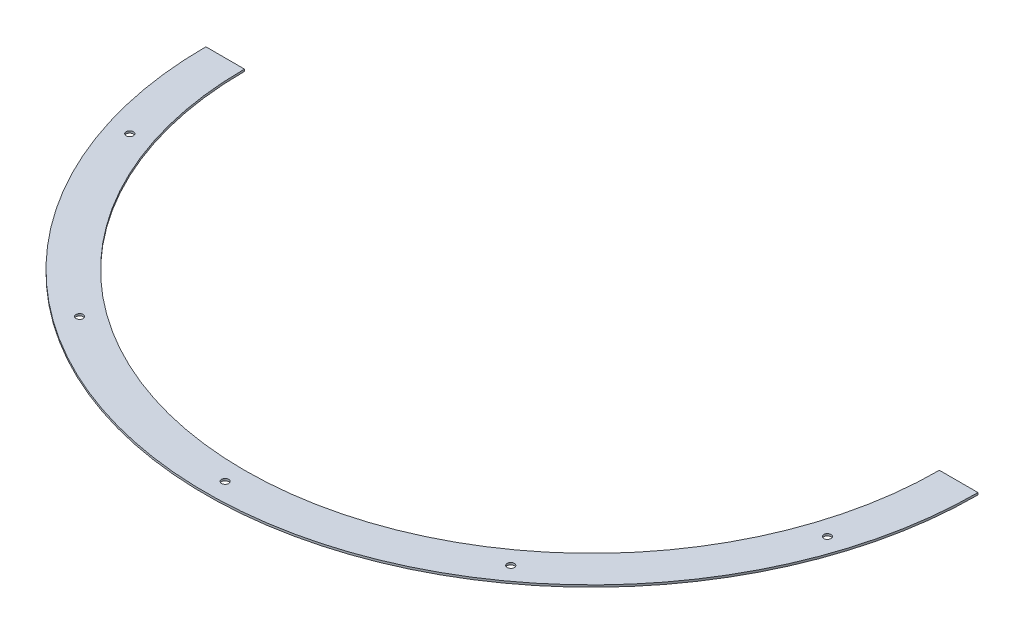
ISO-10303-21;
HEADER;
FILE_DESCRIPTION(('STEP AP214'),'2;1');
FILE_NAME('part.step','',(''),(''),'','','');
FILE_SCHEMA(('AUTOMOTIVE_DESIGN { 1 0 10303 214 1 1 1 1 }'));
ENDSEC;
DATA;
#1=APPLICATION_CONTEXT('core data for automotive mechanical design processes');
#2=APPLICATION_PROTOCOL_DEFINITION('international standard','automotive_design',2000,#1);
#3=PRODUCT_CONTEXT('',#1,'mechanical');
#4=PRODUCT('Part','Part','',(#3));
#5=PRODUCT_RELATED_PRODUCT_CATEGORY('part','',(#4));
#6=PRODUCT_DEFINITION_FORMATION('','',#4);
#7=PRODUCT_DEFINITION_CONTEXT('part definition',#1,'design');
#8=PRODUCT_DEFINITION('design','',#6,#7);
#9=PRODUCT_DEFINITION_SHAPE('','',#8);
#10=(LENGTH_UNIT() NAMED_UNIT(*) SI_UNIT(.MILLI.,.METRE.));
#11=(NAMED_UNIT(*) PLANE_ANGLE_UNIT() SI_UNIT($,.RADIAN.));
#12=(NAMED_UNIT(*) SI_UNIT($,.STERADIAN.) SOLID_ANGLE_UNIT());
#13=UNCERTAINTY_MEASURE_WITH_UNIT(LENGTH_MEASURE(1.E-05),#10,'distance_accuracy_value','');
#14=(GEOMETRIC_REPRESENTATION_CONTEXT(3) GLOBAL_UNCERTAINTY_ASSIGNED_CONTEXT((#13)) GLOBAL_UNIT_ASSIGNED_CONTEXT((#10,
#11,#12)) REPRESENTATION_CONTEXT('',''));
#15=CARTESIAN_POINT('',(0.,0.,0.));
#16=DIRECTION('',(0.,0.,1.));
#17=DIRECTION('',(1.,0.,0.));
#18=AXIS2_PLACEMENT_3D('',#15,#16,#17);
#19=CARTESIAN_POINT('',(0.,0.,0.));
#20=DIRECTION('',(0.,0.,1.));
#21=DIRECTION('',(0.,1.,0.));
#22=AXIS2_PLACEMENT_3D('',#19,#20,#21);
#23=PLANE('',#22);
#24=DIRECTION('',(1.,0.,0.));
#25=VECTOR('',#24,1.);
#26=CARTESIAN_POINT('',(0.,2.032,0.));
#27=LINE('',#26,#25);
#28=CARTESIAN_POINT('',(-381.,2.032,0.));
#29=VERTEX_POINT('',#28);
#30=CARTESIAN_POINT('',(-342.9,2.032,0.));
#31=VERTEX_POINT('',#30);
#32=EDGE_CURVE('E70',#29,#31,#27,.T.);
#33=ORIENTED_EDGE('',*,*,#32,.T.);
#34=DIRECTION('',(0.,-1.,0.));
#35=VECTOR('',#34,1.);
#36=CARTESIAN_POINT('',(-342.9,2.032,0.));
#37=LINE('',#36,#35);
#38=CARTESIAN_POINT('',(-342.9,0.,0.));
#39=VERTEX_POINT('',#38);
#40=EDGE_CURVE('E30',#31,#39,#37,.T.);
#41=ORIENTED_EDGE('',*,*,#40,.T.);
#42=DIRECTION('',(1.,0.,0.));
#43=VECTOR('',#42,1.);
#44=CARTESIAN_POINT('',(0.,0.,0.));
#45=LINE('',#44,#43);
#46=CARTESIAN_POINT('',(-381.,0.,0.));
#47=VERTEX_POINT('',#46);
#48=EDGE_CURVE('E71',#47,#39,#45,.T.);
#49=ORIENTED_EDGE('',*,*,#48,.F.);
#50=DIRECTION('',(0.,-1.,0.));
#51=VECTOR('',#50,1.);
#52=CARTESIAN_POINT('',(-381.,2.032,0.));
#53=LINE('',#52,#51);
#54=EDGE_CURVE('E68',#29,#47,#53,.T.);
#55=ORIENTED_EDGE('',*,*,#54,.F.);
#56=EDGE_LOOP('',(#33,#41,#49,#55));
#57=FACE_BOUND('',#56,.T.);
#58=ADVANCED_FACE('F26',(#57),#23,.F.);
#59=CARTESIAN_POINT('',(342.9,0.,0.));
#60=VERTEX_POINT('',#59);
#61=CARTESIAN_POINT('',(381.,0.,0.));
#62=VERTEX_POINT('',#61);
#63=EDGE_CURVE('E76',#60,#62,#45,.T.);
#64=ORIENTED_EDGE('',*,*,#63,.F.);
#65=DIRECTION('',(0.,-1.,0.));
#66=VECTOR('',#65,1.);
#67=CARTESIAN_POINT('',(342.9,2.032,0.));
#68=LINE('',#67,#66);
#69=CARTESIAN_POINT('',(342.9,2.032,0.));
#70=VERTEX_POINT('',#69);
#71=EDGE_CURVE('E11',#60,#70,#68,.F.);
#72=ORIENTED_EDGE('',*,*,#71,.T.);
#73=CARTESIAN_POINT('',(381.,2.032,0.));
#74=VERTEX_POINT('',#73);
#75=EDGE_CURVE('E48',#70,#74,#27,.T.);
#76=ORIENTED_EDGE('',*,*,#75,.T.);
#77=DIRECTION('',(0.,-1.,0.));
#78=VECTOR('',#77,1.);
#79=CARTESIAN_POINT('',(381.,2.032,0.));
#80=LINE('',#79,#78);
#81=EDGE_CURVE('E77',#62,#74,#80,.F.);
#82=ORIENTED_EDGE('',*,*,#81,.F.);
#83=EDGE_LOOP('',(#64,#72,#76,#82));
#84=FACE_BOUND('',#83,.T.);
#85=ADVANCED_FACE('F128',(#84),#23,.F.);
#86=CARTESIAN_POINT('',(0.,2.032,0.));
#87=DIRECTION('',(0.,1.,0.));
#88=DIRECTION('',(-1.,0.,0.));
#89=AXIS2_PLACEMENT_3D('',#86,#87,#88);
#90=PLANE('',#89);
#91=ORIENTED_EDGE('',*,*,#32,.F.);
#92=CARTESIAN_POINT('',(0.,2.032,0.));
#93=DIRECTION('',(0.,1.,0.));
#94=DIRECTION('',(-1.,0.,0.));
#95=AXIS2_PLACEMENT_3D('',#92,#93,#94);
#96=CIRCLE('',#95,381.);
#97=EDGE_CURVE('E81',#29,#74,#96,.T.);
#98=ORIENTED_EDGE('',*,*,#97,.T.);
#99=ORIENTED_EDGE('',*,*,#75,.F.);
#100=CARTESIAN_POINT('',(0.,2.032,0.));
#101=DIRECTION('',(0.,1.,0.));
#102=DIRECTION('',(-1.,0.,0.));
#103=AXIS2_PLACEMENT_3D('',#100,#101,#102);
#104=CIRCLE('',#103,342.9);
#105=EDGE_CURVE('E82',#31,#70,#104,.T.);
#106=ORIENTED_EDGE('',*,*,#105,.F.);
#107=EDGE_LOOP('',(#91,#98,#99,#106));
#108=FACE_BOUND('',#107,.T.);
#109=CARTESIAN_POINT('',(344.234906073032,2.032,111.848701114009));
#110=DIRECTION('',(0.,1.,0.));
#111=DIRECTION('',(0.309016994374938,0.,-0.951056516295157));
#112=AXIS2_PLACEMENT_3D('',#109,#110,#111);
#113=CIRCLE('',#112,3.55599999999999);
#114=CARTESIAN_POINT('',(345.333770505029,2.032,108.466744142063));
#115=VERTEX_POINT('',#114);
#116=EDGE_CURVE('E120',#115,#115,#113,.T.);
#117=ORIENTED_EDGE('',*,*,#116,.F.);
#118=EDGE_LOOP('',(#117));
#119=FACE_BOUND('',#118,.T.);
#120=CARTESIAN_POINT('',(212.748872067263,2.032,292.82370111401));
#121=DIRECTION('',(0.,1.,0.));
#122=DIRECTION('',(0.809016994374942,0.,-0.58778525229248));
#123=AXIS2_PLACEMENT_3D('',#120,#121,#122);
#124=CIRCLE('',#123,3.55599999999999);
#125=CARTESIAN_POINT('',(215.625736499261,2.032,290.733536756858));
#126=VERTEX_POINT('',#125);
#127=EDGE_CURVE('E114',#126,#126,#124,.T.);
#128=ORIENTED_EDGE('',*,*,#127,.F.);
#129=EDGE_LOOP('',(#128));
#130=FACE_BOUND('',#129,.T.);
#131=CARTESIAN_POINT('',(2.56766932748339E-12,2.032,361.95));
#132=DIRECTION('',(0.,1.,0.));
#133=DIRECTION('',(1.,0.,0.));
#134=AXIS2_PLACEMENT_3D('',#131,#132,#133);
#135=CIRCLE('',#134,3.55599999999999);
#136=CARTESIAN_POINT('',(3.55600000000256,2.032,361.95));
#137=VERTEX_POINT('',#136);
#138=EDGE_CURVE('E108',#137,#137,#135,.T.);
#139=ORIENTED_EDGE('',*,*,#138,.F.);
#140=EDGE_LOOP('',(#139));
#141=FACE_BOUND('',#140,.T.);
#142=CARTESIAN_POINT('',(-212.748872067259,2.032,292.823701114013));
#143=DIRECTION('',(0.,1.,0.));
#144=DIRECTION('',(0.809016994374951,0.,0.587785252292469));
#145=AXIS2_PLACEMENT_3D('',#142,#143,#144);
#146=CIRCLE('',#145,3.55599999999999);
#147=CARTESIAN_POINT('',(-209.872007635262,2.032,294.913865471165));
#148=VERTEX_POINT('',#147);
#149=EDGE_CURVE('E102',#148,#148,#146,.T.);
#150=ORIENTED_EDGE('',*,*,#149,.F.);
#151=EDGE_LOOP('',(#150));
#152=FACE_BOUND('',#151,.T.);
#153=CARTESIAN_POINT('',(-344.23490607303,2.032,111.848701114014));
#154=DIRECTION('',(0.,1.,0.));
#155=DIRECTION('',(0.309016994374952,0.,0.951056516295152));
#156=AXIS2_PLACEMENT_3D('',#153,#154,#155);
#157=CIRCLE('',#156,3.55599999999999);
#158=CARTESIAN_POINT('',(-343.136041641033,2.032,115.230658085959));
#159=VERTEX_POINT('',#158);
#160=EDGE_CURVE('E96',#159,#159,#157,.T.);
#161=ORIENTED_EDGE('',*,*,#160,.F.);
#162=EDGE_LOOP('',(#161));
#163=FACE_BOUND('',#162,.T.);
#164=ADVANCED_FACE('F79',(#108,#119,#130,#141,#152,#163),#90,.T.);
#165=CARTESIAN_POINT('',(0.,0.,0.));
#166=DIRECTION('',(0.,1.,0.));
#167=DIRECTION('',(-1.,0.,0.));
#168=AXIS2_PLACEMENT_3D('',#165,#166,#167);
#169=PLANE('',#168);
#170=CARTESIAN_POINT('',(344.234906073032,0.,111.848701114009));
#171=DIRECTION('',(0.,1.,0.));
#172=DIRECTION('',(-1.,0.,0.));
#173=AXIS2_PLACEMENT_3D('',#170,#171,#172);
#174=CIRCLE('',#173,3.55599999999999);
#175=CARTESIAN_POINT('',(340.678906073032,0.,111.848701114009));
#176=VERTEX_POINT('',#175);
#177=EDGE_CURVE('E117',#176,#176,#174,.F.);
#178=ORIENTED_EDGE('',*,*,#177,.F.);
#179=EDGE_LOOP('',(#178));
#180=FACE_BOUND('',#179,.T.);
#181=CARTESIAN_POINT('',(212.748872067263,0.,292.82370111401));
#182=DIRECTION('',(0.,1.,0.));
#183=DIRECTION('',(-1.,0.,0.));
#184=AXIS2_PLACEMENT_3D('',#181,#182,#183);
#185=CIRCLE('',#184,3.55599999999999);
#186=CARTESIAN_POINT('',(209.192872067263,0.,292.82370111401));
#187=VERTEX_POINT('',#186);
#188=EDGE_CURVE('E111',#187,#187,#185,.F.);
#189=ORIENTED_EDGE('',*,*,#188,.F.);
#190=EDGE_LOOP('',(#189));
#191=FACE_BOUND('',#190,.T.);
#192=CARTESIAN_POINT('',(2.56766932748339E-12,0.,361.95));
#193=DIRECTION('',(0.,1.,0.));
#194=DIRECTION('',(-1.,0.,0.));
#195=AXIS2_PLACEMENT_3D('',#192,#193,#194);
#196=CIRCLE('',#195,3.55599999999999);
#197=CARTESIAN_POINT('',(-3.55599999999743,0.,361.95));
#198=VERTEX_POINT('',#197);
#199=EDGE_CURVE('E105',#198,#198,#196,.F.);
#200=ORIENTED_EDGE('',*,*,#199,.F.);
#201=EDGE_LOOP('',(#200));
#202=FACE_BOUND('',#201,.T.);
#203=CARTESIAN_POINT('',(-212.748872067259,0.,292.823701114013));
#204=DIRECTION('',(0.,1.,0.));
#205=DIRECTION('',(-1.,0.,0.));
#206=AXIS2_PLACEMENT_3D('',#203,#204,#205);
#207=CIRCLE('',#206,3.55599999999999);
#208=CARTESIAN_POINT('',(-216.304872067259,0.,292.823701114013));
#209=VERTEX_POINT('',#208);
#210=EDGE_CURVE('E99',#209,#209,#207,.F.);
#211=ORIENTED_EDGE('',*,*,#210,.F.);
#212=EDGE_LOOP('',(#211));
#213=FACE_BOUND('',#212,.T.);
#214=CARTESIAN_POINT('',(-344.23490607303,0.,111.848701114014));
#215=DIRECTION('',(0.,1.,0.));
#216=DIRECTION('',(-1.,0.,0.));
#217=AXIS2_PLACEMENT_3D('',#214,#215,#216);
#218=CIRCLE('',#217,3.55599999999999);
#219=CARTESIAN_POINT('',(-347.79090607303,0.,111.848701114014));
#220=VERTEX_POINT('',#219);
#221=EDGE_CURVE('E93',#220,#220,#218,.F.);
#222=ORIENTED_EDGE('',*,*,#221,.F.);
#223=EDGE_LOOP('',(#222));
#224=FACE_BOUND('',#223,.T.);
#225=CARTESIAN_POINT('',(0.,0.,0.));
#226=DIRECTION('',(0.,1.,0.));
#227=DIRECTION('',(-1.,0.,0.));
#228=AXIS2_PLACEMENT_3D('',#225,#226,#227);
#229=CIRCLE('',#228,381.);
#230=EDGE_CURVE('E84',#47,#62,#229,.T.);
#231=ORIENTED_EDGE('',*,*,#230,.F.);
#232=ORIENTED_EDGE('',*,*,#48,.T.);
#233=CARTESIAN_POINT('',(0.,0.,0.));
#234=DIRECTION('',(0.,1.,0.));
#235=DIRECTION('',(-1.,0.,0.));
#236=AXIS2_PLACEMENT_3D('',#233,#234,#235);
#237=CIRCLE('',#236,342.9);
#238=EDGE_CURVE('E90',#39,#60,#237,.T.);
#239=ORIENTED_EDGE('',*,*,#238,.T.);
#240=ORIENTED_EDGE('',*,*,#63,.T.);
#241=EDGE_LOOP('',(#231,#232,#239,#240));
#242=FACE_BOUND('',#241,.T.);
#243=ADVANCED_FACE('F126',(#180,#191,#202,#213,#224,#242),#169,.F.);
#244=CARTESIAN_POINT('',(0.,2.032,0.));
#245=DIRECTION('',(0.,-1.,0.));
#246=DIRECTION('',(1.,0.,0.));
#247=AXIS2_PLACEMENT_3D('',#244,#245,#246);
#248=CYLINDRICAL_SURFACE('',#247,381.);
#249=ORIENTED_EDGE('',*,*,#97,.F.);
#250=ORIENTED_EDGE('',*,*,#54,.T.);
#251=ORIENTED_EDGE('',*,*,#230,.T.);
#252=ORIENTED_EDGE('',*,*,#81,.T.);
#253=EDGE_LOOP('',(#249,#250,#251,#252));
#254=FACE_BOUND('',#253,.T.);
#255=ADVANCED_FACE('F28',(#254),#248,.T.);
#256=CARTESIAN_POINT('',(0.,2.032,0.));
#257=DIRECTION('',(0.,-1.,0.));
#258=DIRECTION('',(1.,0.,0.));
#259=AXIS2_PLACEMENT_3D('',#256,#257,#258);
#260=CYLINDRICAL_SURFACE('',#259,342.9);
#261=ORIENTED_EDGE('',*,*,#40,.F.);
#262=ORIENTED_EDGE('',*,*,#105,.T.);
#263=ORIENTED_EDGE('',*,*,#71,.F.);
#264=ORIENTED_EDGE('',*,*,#238,.F.);
#265=EDGE_LOOP('',(#261,#262,#263,#264));
#266=FACE_BOUND('',#265,.T.);
#267=ADVANCED_FACE('F129',(#266),#260,.F.);
#268=CARTESIAN_POINT('',(-344.23490607303,-0.00100000000000013,111.848701114014));
#269=DIRECTION('',(0.,1.,0.));
#270=DIRECTION('',(-1.,0.,0.));
#271=AXIS2_PLACEMENT_3D('',#268,#269,#270);
#272=CYLINDRICAL_SURFACE('',#271,3.55599999999999);
#273=ORIENTED_EDGE('',*,*,#160,.T.);
#274=EDGE_LOOP('',(#273));
#275=FACE_BOUND('',#274,.T.);
#276=ORIENTED_EDGE('',*,*,#221,.T.);
#277=EDGE_LOOP('',(#276));
#278=FACE_BOUND('',#277,.T.);
#279=ADVANCED_FACE('F131',(#275,#278),#272,.F.);
#280=CARTESIAN_POINT('',(-212.748872067259,-0.00100000000000013,292.823701114013));
#281=DIRECTION('',(0.,1.,0.));
#282=DIRECTION('',(-1.,0.,0.));
#283=AXIS2_PLACEMENT_3D('',#280,#281,#282);
#284=CYLINDRICAL_SURFACE('',#283,3.55599999999999);
#285=ORIENTED_EDGE('',*,*,#149,.T.);
#286=EDGE_LOOP('',(#285));
#287=FACE_BOUND('',#286,.T.);
#288=ORIENTED_EDGE('',*,*,#210,.T.);
#289=EDGE_LOOP('',(#288));
#290=FACE_BOUND('',#289,.T.);
#291=ADVANCED_FACE('F137',(#287,#290),#284,.F.);
#292=CARTESIAN_POINT('',(2.56766932748339E-12,-0.00100000000000013,361.95));
#293=DIRECTION('',(0.,1.,0.));
#294=DIRECTION('',(-1.,0.,0.));
#295=AXIS2_PLACEMENT_3D('',#292,#293,#294);
#296=CYLINDRICAL_SURFACE('',#295,3.55599999999999);
#297=ORIENTED_EDGE('',*,*,#138,.T.);
#298=EDGE_LOOP('',(#297));
#299=FACE_BOUND('',#298,.T.);
#300=ORIENTED_EDGE('',*,*,#199,.T.);
#301=EDGE_LOOP('',(#300));
#302=FACE_BOUND('',#301,.T.);
#303=ADVANCED_FACE('F154',(#299,#302),#296,.F.);
#304=CARTESIAN_POINT('',(212.748872067263,-0.00100000000000013,292.82370111401));
#305=DIRECTION('',(0.,1.,0.));
#306=DIRECTION('',(-1.,0.,0.));
#307=AXIS2_PLACEMENT_3D('',#304,#305,#306);
#308=CYLINDRICAL_SURFACE('',#307,3.55599999999999);
#309=ORIENTED_EDGE('',*,*,#127,.T.);
#310=EDGE_LOOP('',(#309));
#311=FACE_BOUND('',#310,.T.);
#312=ORIENTED_EDGE('',*,*,#188,.T.);
#313=EDGE_LOOP('',(#312));
#314=FACE_BOUND('',#313,.T.);
#315=ADVANCED_FACE('F150',(#311,#314),#308,.F.);
#316=CARTESIAN_POINT('',(344.234906073032,-0.00100000000000013,111.848701114009));
#317=DIRECTION('',(0.,1.,0.));
#318=DIRECTION('',(-1.,0.,0.));
#319=AXIS2_PLACEMENT_3D('',#316,#317,#318);
#320=CYLINDRICAL_SURFACE('',#319,3.55599999999999);
#321=ORIENTED_EDGE('',*,*,#116,.T.);
#322=EDGE_LOOP('',(#321));
#323=FACE_BOUND('',#322,.T.);
#324=ORIENTED_EDGE('',*,*,#177,.T.);
#325=EDGE_LOOP('',(#324));
#326=FACE_BOUND('',#325,.T.);
#327=ADVANCED_FACE('F146',(#323,#326),#320,.F.);
#328=CLOSED_SHELL('',(#58,#85,#164,#243,#255,#267,#279,#291,#303,#315,#327));
#329=MANIFOLD_SOLID_BREP('B2',#328);
#330=ADVANCED_BREP_SHAPE_REPRESENTATION('',(#18,#329),#14);
#331=SHAPE_DEFINITION_REPRESENTATION(#9,#330);
ENDSEC;
END-ISO-10303-21;
